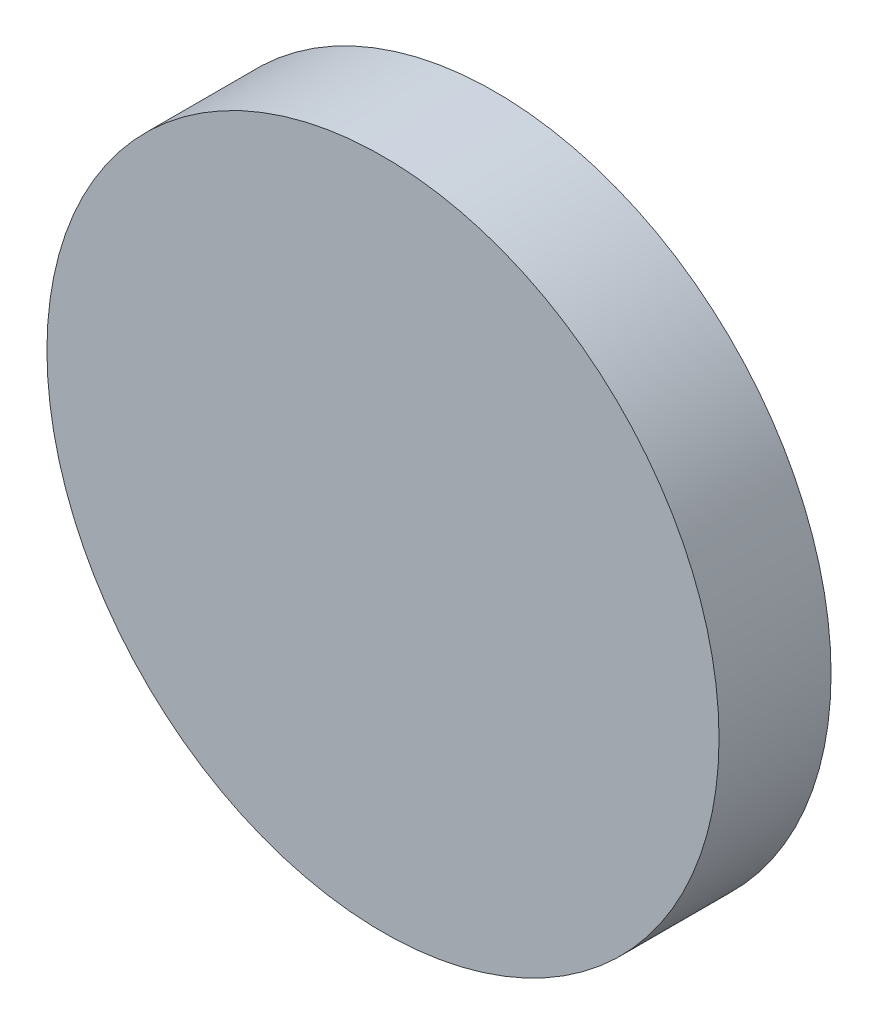
ISO-10303-21;
HEADER;
FILE_DESCRIPTION(('STEP AP214'),'2;1');
FILE_NAME('part.step','',(''),(''),'','','');
FILE_SCHEMA(('AUTOMOTIVE_DESIGN { 1 0 10303 214 1 1 1 1 }'));
ENDSEC;
DATA;
#1=APPLICATION_CONTEXT('core data for automotive mechanical design processes');
#2=APPLICATION_PROTOCOL_DEFINITION('international standard','automotive_design',2000,#1);
#3=PRODUCT_CONTEXT('',#1,'mechanical');
#4=PRODUCT('Part','Part','',(#3));
#5=PRODUCT_RELATED_PRODUCT_CATEGORY('part','',(#4));
#6=PRODUCT_DEFINITION_FORMATION('','',#4);
#7=PRODUCT_DEFINITION_CONTEXT('part definition',#1,'design');
#8=PRODUCT_DEFINITION('design','',#6,#7);
#9=PRODUCT_DEFINITION_SHAPE('','',#8);
#10=(LENGTH_UNIT() NAMED_UNIT(*) SI_UNIT(.MILLI.,.METRE.));
#11=(NAMED_UNIT(*) PLANE_ANGLE_UNIT() SI_UNIT($,.RADIAN.));
#12=(NAMED_UNIT(*) SI_UNIT($,.STERADIAN.) SOLID_ANGLE_UNIT());
#13=UNCERTAINTY_MEASURE_WITH_UNIT(LENGTH_MEASURE(1.E-05),#10,'distance_accuracy_value','');
#14=(GEOMETRIC_REPRESENTATION_CONTEXT(3) GLOBAL_UNCERTAINTY_ASSIGNED_CONTEXT((#13)) GLOBAL_UNIT_ASSIGNED_CONTEXT((#10,
#11,#12)) REPRESENTATION_CONTEXT('',''));
#15=CARTESIAN_POINT('',(0.,0.,0.));
#16=DIRECTION('',(0.,0.,1.));
#17=DIRECTION('',(1.,0.,0.));
#18=AXIS2_PLACEMENT_3D('',#15,#16,#17);
#19=CARTESIAN_POINT('',(0.,0.,0.5));
#20=DIRECTION('',(0.,0.,-1.));
#21=DIRECTION('',(-1.,0.,0.));
#22=AXIS2_PLACEMENT_3D('',#19,#20,#21);
#23=CYLINDRICAL_SURFACE('',#22,1.5);
#24=CARTESIAN_POINT('',(0.,0.,0.5));
#25=DIRECTION('',(0.,0.,1.));
#26=DIRECTION('',(1.,0.,0.));
#27=AXIS2_PLACEMENT_3D('',#24,#25,#26);
#28=CIRCLE('',#27,1.5);
#29=CARTESIAN_POINT('',(1.5,0.,0.5));
#30=VERTEX_POINT('',#29);
#31=EDGE_CURVE('E10',#30,#30,#28,.T.);
#32=ORIENTED_EDGE('',*,*,#31,.F.);
#33=EDGE_LOOP('',(#32));
#34=FACE_BOUND('',#33,.T.);
#35=CARTESIAN_POINT('',(0.,0.,0.));
#36=DIRECTION('',(0.,0.,1.));
#37=DIRECTION('',(1.,0.,0.));
#38=AXIS2_PLACEMENT_3D('',#35,#36,#37);
#39=CIRCLE('',#38,1.5);
#40=CARTESIAN_POINT('',(1.5,0.,0.));
#41=VERTEX_POINT('',#40);
#42=EDGE_CURVE('E38',#41,#41,#39,.T.);
#43=ORIENTED_EDGE('',*,*,#42,.T.);
#44=EDGE_LOOP('',(#43));
#45=FACE_BOUND('',#44,.T.);
#46=ADVANCED_FACE('F35',(#34,#45),#23,.T.);
#47=CARTESIAN_POINT('',(0.,0.,0.5));
#48=DIRECTION('',(0.,0.,1.));
#49=DIRECTION('',(1.,0.,0.));
#50=AXIS2_PLACEMENT_3D('',#47,#48,#49);
#51=PLANE('',#50);
#52=ORIENTED_EDGE('',*,*,#31,.T.);
#53=EDGE_LOOP('',(#52));
#54=FACE_BOUND('',#53,.T.);
#55=ADVANCED_FACE('F50',(#54),#51,.T.);
#56=CARTESIAN_POINT('',(0.,0.,0.));
#57=DIRECTION('',(0.,0.,1.));
#58=DIRECTION('',(1.,0.,0.));
#59=AXIS2_PLACEMENT_3D('',#56,#57,#58);
#60=PLANE('',#59);
#61=ORIENTED_EDGE('',*,*,#42,.F.);
#62=EDGE_LOOP('',(#61));
#63=FACE_BOUND('',#62,.T.);
#64=ADVANCED_FACE('F48',(#63),#60,.F.);
#65=CLOSED_SHELL('',(#46,#55,#64));
#66=MANIFOLD_SOLID_BREP('B2',#65);
#67=ADVANCED_BREP_SHAPE_REPRESENTATION('',(#18,#66),#14);
#68=SHAPE_DEFINITION_REPRESENTATION(#9,#67);
ENDSEC;
END-ISO-10303-21;
